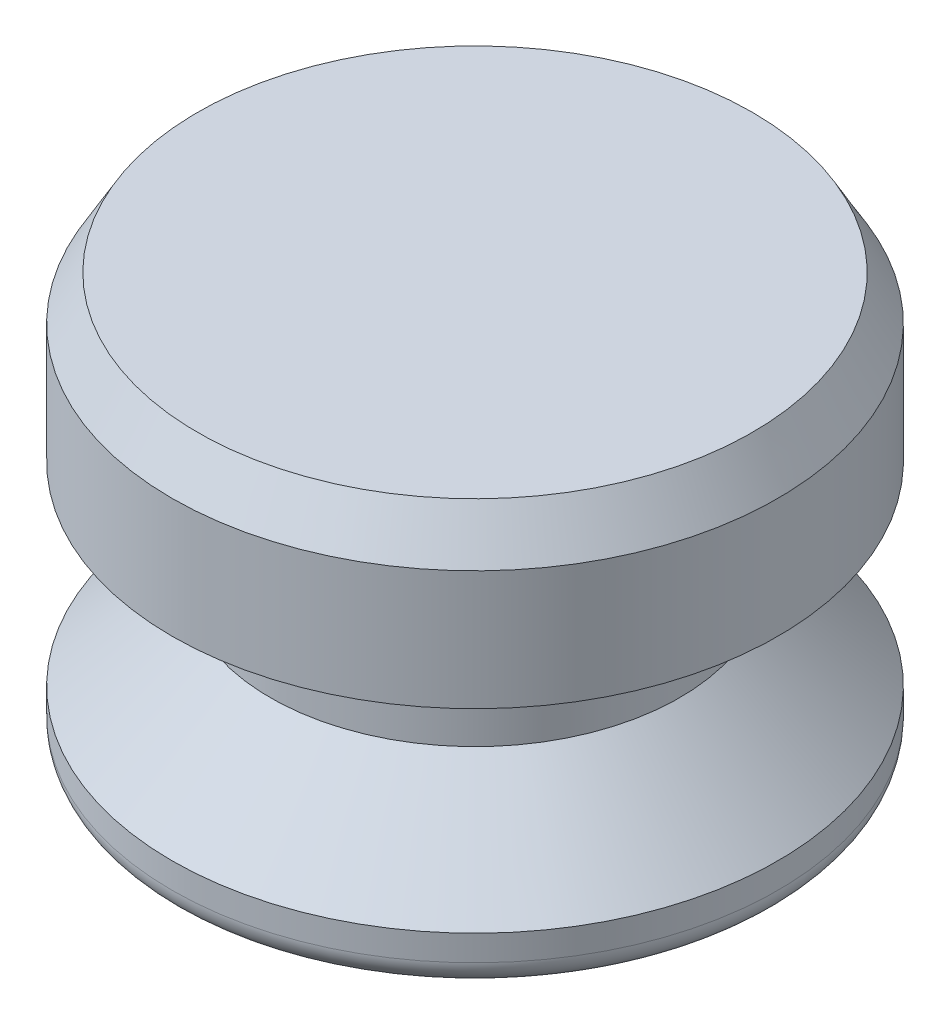
ISO-10303-21;
HEADER;
FILE_DESCRIPTION(('STEP AP214'),'2;1');
FILE_NAME('part.step','',(''),(''),'','','');
FILE_SCHEMA(('AUTOMOTIVE_DESIGN { 1 0 10303 214 1 1 1 1 }'));
ENDSEC;
DATA;
#1=APPLICATION_CONTEXT('core data for automotive mechanical design processes');
#2=APPLICATION_PROTOCOL_DEFINITION('international standard','automotive_design',2000,#1);
#3=PRODUCT_CONTEXT('',#1,'mechanical');
#4=PRODUCT('Part','Part','',(#3));
#5=PRODUCT_RELATED_PRODUCT_CATEGORY('part','',(#4));
#6=PRODUCT_DEFINITION_FORMATION('','',#4);
#7=PRODUCT_DEFINITION_CONTEXT('part definition',#1,'design');
#8=PRODUCT_DEFINITION('design','',#6,#7);
#9=PRODUCT_DEFINITION_SHAPE('','',#8);
#10=(LENGTH_UNIT() NAMED_UNIT(*) SI_UNIT(.MILLI.,.METRE.));
#11=(NAMED_UNIT(*) PLANE_ANGLE_UNIT() SI_UNIT($,.RADIAN.));
#12=(NAMED_UNIT(*) SI_UNIT($,.STERADIAN.) SOLID_ANGLE_UNIT());
#13=UNCERTAINTY_MEASURE_WITH_UNIT(LENGTH_MEASURE(1.E-05),#10,'distance_accuracy_value','');
#14=(GEOMETRIC_REPRESENTATION_CONTEXT(3) GLOBAL_UNCERTAINTY_ASSIGNED_CONTEXT((#13)) GLOBAL_UNIT_ASSIGNED_CONTEXT((#10,
#11,#12)) REPRESENTATION_CONTEXT('',''));
#15=CARTESIAN_POINT('',(0.,0.,0.));
#16=DIRECTION('',(0.,0.,1.));
#17=DIRECTION('',(1.,0.,0.));
#18=AXIS2_PLACEMENT_3D('',#15,#16,#17);
#19=CARTESIAN_POINT('',(0.,0.,0.));
#20=DIRECTION('',(0.,1.,0.));
#21=DIRECTION('',(0.,0.,1.));
#22=AXIS2_PLACEMENT_3D('',#19,#20,#21);
#23=PLANE('',#22);
#24=CARTESIAN_POINT('',(0.,0.,0.));
#25=DIRECTION('',(0.,1.,0.));
#26=DIRECTION('',(0.,0.,1.));
#27=AXIS2_PLACEMENT_3D('',#24,#25,#26);
#28=CIRCLE('',#27,8.60425);
#29=CARTESIAN_POINT('',(0.,0.,8.60425));
#30=VERTEX_POINT('',#29);
#31=EDGE_CURVE('E46',#30,#30,#28,.F.);
#32=ORIENTED_EDGE('',*,*,#31,.T.);
#33=EDGE_LOOP('',(#32));
#34=FACE_BOUND('',#33,.T.);
#35=ADVANCED_FACE('F31',(#34),#23,.F.);
#36=CARTESIAN_POINT('',(0.,0.,0.));
#37=DIRECTION('',(0.,-1.,0.));
#38=DIRECTION('',(0.,0.,-1.));
#39=AXIS2_PLACEMENT_3D('',#36,#37,#38);
#40=CYLINDRICAL_SURFACE('',#39,9.398);
#41=CARTESIAN_POINT('',(0.,0.793749999999999,0.));
#42=DIRECTION('',(0.,1.,0.));
#43=DIRECTION('',(0.,0.,1.));
#44=AXIS2_PLACEMENT_3D('',#41,#42,#43);
#45=CIRCLE('',#44,9.398);
#46=CARTESIAN_POINT('',(0.,0.793749999999999,9.398));
#47=VERTEX_POINT('',#46);
#48=EDGE_CURVE('E42',#47,#47,#45,.T.);
#49=ORIENTED_EDGE('',*,*,#48,.T.);
#50=EDGE_LOOP('',(#49));
#51=FACE_BOUND('',#50,.T.);
#52=CARTESIAN_POINT('',(0.,1.5875,0.));
#53=DIRECTION('',(0.,-1.,0.));
#54=DIRECTION('',(0.,0.,-1.));
#55=AXIS2_PLACEMENT_3D('',#52,#53,#54);
#56=CIRCLE('',#55,9.398);
#57=CARTESIAN_POINT('',(0.,1.5875,-9.398));
#58=VERTEX_POINT('',#57);
#59=EDGE_CURVE('E51',#58,#58,#56,.T.);
#60=ORIENTED_EDGE('',*,*,#59,.T.);
#61=EDGE_LOOP('',(#60));
#62=FACE_BOUND('',#61,.T.);
#63=ADVANCED_FACE('F80',(#51,#62),#40,.T.);
#64=CARTESIAN_POINT('',(0.,4.445,0.));
#65=DIRECTION('',(0.,-1.,0.));
#66=DIRECTION('',(0.,0.,-1.));
#67=AXIS2_PLACEMENT_3D('',#64,#65,#66);
#68=CONICAL_SURFACE('',#67,6.35,0.817645045832702);
#69=ORIENTED_EDGE('',*,*,#59,.F.);
#70=EDGE_LOOP('',(#69));
#71=FACE_BOUND('',#70,.T.);
#72=CARTESIAN_POINT('',(0.,4.445,0.));
#73=DIRECTION('',(0.,-1.,0.));
#74=DIRECTION('',(0.,0.,-1.));
#75=AXIS2_PLACEMENT_3D('',#72,#73,#74);
#76=CIRCLE('',#75,6.35);
#77=CARTESIAN_POINT('',(0.,4.445,-6.35));
#78=VERTEX_POINT('',#77);
#79=EDGE_CURVE('E54',#78,#78,#76,.T.);
#80=ORIENTED_EDGE('',*,*,#79,.T.);
#81=EDGE_LOOP('',(#80));
#82=FACE_BOUND('',#81,.T.);
#83=ADVANCED_FACE('F86',(#71,#82),#68,.T.);
#84=CARTESIAN_POINT('',(0.,0.,0.));
#85=DIRECTION('',(0.,-1.,0.));
#86=DIRECTION('',(0.,0.,-1.));
#87=AXIS2_PLACEMENT_3D('',#84,#85,#86);
#88=CYLINDRICAL_SURFACE('',#87,6.35);
#89=ORIENTED_EDGE('',*,*,#79,.F.);
#90=EDGE_LOOP('',(#89));
#91=FACE_BOUND('',#90,.T.);
#92=CARTESIAN_POINT('',(0.,7.62,0.));
#93=DIRECTION('',(0.,-1.,0.));
#94=DIRECTION('',(0.,0.,-1.));
#95=AXIS2_PLACEMENT_3D('',#92,#93,#94);
#96=CIRCLE('',#95,6.35);
#97=CARTESIAN_POINT('',(0.,7.62,-6.35));
#98=VERTEX_POINT('',#97);
#99=EDGE_CURVE('E57',#98,#98,#96,.T.);
#100=ORIENTED_EDGE('',*,*,#99,.T.);
#101=EDGE_LOOP('',(#100));
#102=FACE_BOUND('',#101,.T.);
#103=ADVANCED_FACE('F76',(#91,#102),#88,.T.);
#104=CARTESIAN_POINT('',(-6.35,7.62,0.));
#105=DIRECTION('',(0.,1.,0.));
#106=DIRECTION('',(0.,0.,1.));
#107=AXIS2_PLACEMENT_3D('',#104,#105,#106);
#108=PLANE('',#107);
#109=ORIENTED_EDGE('',*,*,#99,.F.);
#110=EDGE_LOOP('',(#109));
#111=FACE_BOUND('',#110,.T.);
#112=CARTESIAN_POINT('',(0.,7.62,0.));
#113=DIRECTION('',(0.,-1.,0.));
#114=DIRECTION('',(0.,0.,-1.));
#115=AXIS2_PLACEMENT_3D('',#112,#113,#114);
#116=CIRCLE('',#115,9.398);
#117=CARTESIAN_POINT('',(0.,7.62,-9.398));
#118=VERTEX_POINT('',#117);
#119=EDGE_CURVE('E60',#118,#118,#116,.T.);
#120=ORIENTED_EDGE('',*,*,#119,.T.);
#121=EDGE_LOOP('',(#120));
#122=FACE_BOUND('',#121,.T.);
#123=ADVANCED_FACE('F64',(#111,#122),#108,.F.);
#124=CARTESIAN_POINT('',(0.,0.,0.));
#125=DIRECTION('',(0.,-1.,0.));
#126=DIRECTION('',(0.,0.,-1.));
#127=AXIS2_PLACEMENT_3D('',#124,#125,#126);
#128=CYLINDRICAL_SURFACE('',#127,9.398);
#129=CARTESIAN_POINT('',(0.,11.3251846714922,0.));
#130=DIRECTION('',(0.,-1.,0.));
#131=DIRECTION('',(0.,0.,-1.));
#132=AXIS2_PLACEMENT_3D('',#129,#130,#131);
#133=CIRCLE('',#132,9.398);
#134=CARTESIAN_POINT('',(0.,11.3251846714922,-9.398));
#135=VERTEX_POINT('',#134);
#136=EDGE_CURVE('E38',#135,#135,#133,.T.);
#137=ORIENTED_EDGE('',*,*,#136,.T.);
#138=EDGE_LOOP('',(#137));
#139=FACE_BOUND('',#138,.T.);
#140=ORIENTED_EDGE('',*,*,#119,.F.);
#141=EDGE_LOOP('',(#140));
#142=FACE_BOUND('',#141,.T.);
#143=ADVANCED_FACE('F66',(#139,#142),#128,.T.);
#144=CARTESIAN_POINT('',(-9.398,12.7,0.));
#145=DIRECTION('',(0.,-1.,0.));
#146=DIRECTION('',(0.,0.,-1.));
#147=AXIS2_PLACEMENT_3D('',#144,#145,#146);
#148=PLANE('',#147);
#149=CARTESIAN_POINT('',(0.,12.7,0.));
#150=DIRECTION('',(0.,-1.,0.));
#151=DIRECTION('',(0.,0.,-1.));
#152=AXIS2_PLACEMENT_3D('',#149,#150,#151);
#153=CIRCLE('',#152,8.60424999999999);
#154=CARTESIAN_POINT('',(0.,12.7,-8.60424999999999));
#155=VERTEX_POINT('',#154);
#156=EDGE_CURVE('E10',#155,#155,#153,.F.);
#157=ORIENTED_EDGE('',*,*,#156,.T.);
#158=EDGE_LOOP('',(#157));
#159=FACE_BOUND('',#158,.T.);
#160=ADVANCED_FACE('F68',(#159),#148,.F.);
#161=CARTESIAN_POINT('',(0.,0.793749999999999,0.));
#162=DIRECTION('',(0.,1.,0.));
#163=DIRECTION('',(0.,0.,1.));
#164=AXIS2_PLACEMENT_3D('',#161,#162,#163);
#165=TOROIDAL_SURFACE('',#164,8.60425,0.79375);
#166=ORIENTED_EDGE('',*,*,#48,.F.);
#167=EDGE_LOOP('',(#166));
#168=FACE_BOUND('',#167,.T.);
#169=ORIENTED_EDGE('',*,*,#31,.F.);
#170=EDGE_LOOP('',(#169));
#171=FACE_BOUND('',#170,.T.);
#172=ADVANCED_FACE('F74',(#168,#171),#165,.T.);
#173=CARTESIAN_POINT('',(0.,11.3251846714922,0.));
#174=DIRECTION('',(0.,-1.,0.));
#175=DIRECTION('',(0.,0.,-1.));
#176=AXIS2_PLACEMENT_3D('',#173,#174,#175);
#177=CONICAL_SURFACE('',#176,9.398,0.5235987755983);
#178=ORIENTED_EDGE('',*,*,#156,.F.);
#179=EDGE_LOOP('',(#178));
#180=FACE_BOUND('',#179,.T.);
#181=ORIENTED_EDGE('',*,*,#136,.F.);
#182=EDGE_LOOP('',(#181));
#183=FACE_BOUND('',#182,.T.);
#184=ADVANCED_FACE('F33',(#180,#183),#177,.T.);
#185=CLOSED_SHELL('',(#35,#63,#83,#103,#123,#143,#160,#172,#184));
#186=MANIFOLD_SOLID_BREP('B2',#185);
#187=ADVANCED_BREP_SHAPE_REPRESENTATION('',(#18,#186),#14);
#188=SHAPE_DEFINITION_REPRESENTATION(#9,#187);
ENDSEC;
END-ISO-10303-21;
